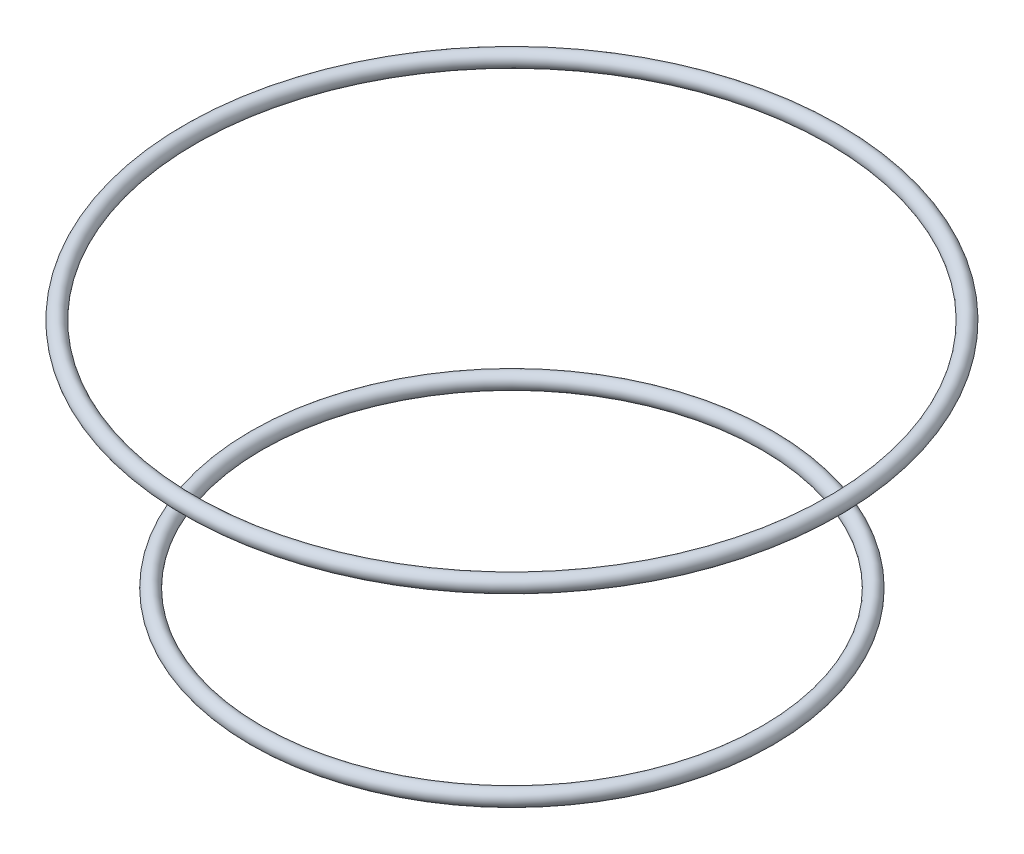
ISO-10303-21;
HEADER;
FILE_DESCRIPTION(('STEP AP214'),'2;1');
FILE_NAME('part.step','',(''),(''),'','','');
FILE_SCHEMA(('AUTOMOTIVE_DESIGN { 1 0 10303 214 1 1 1 1 }'));
ENDSEC;
DATA;
#1=APPLICATION_CONTEXT('core data for automotive mechanical design processes');
#2=APPLICATION_PROTOCOL_DEFINITION('international standard','automotive_design',2000,#1);
#3=PRODUCT_CONTEXT('',#1,'mechanical');
#4=PRODUCT('Part','Part','',(#3));
#5=PRODUCT_RELATED_PRODUCT_CATEGORY('part','',(#4));
#6=PRODUCT_DEFINITION_FORMATION('','',#4);
#7=PRODUCT_DEFINITION_CONTEXT('part definition',#1,'design');
#8=PRODUCT_DEFINITION('design','',#6,#7);
#9=PRODUCT_DEFINITION_SHAPE('','',#8);
#10=(LENGTH_UNIT() NAMED_UNIT(*) SI_UNIT(.MILLI.,.METRE.));
#11=(NAMED_UNIT(*) PLANE_ANGLE_UNIT() SI_UNIT($,.RADIAN.));
#12=(NAMED_UNIT(*) SI_UNIT($,.STERADIAN.) SOLID_ANGLE_UNIT());
#13=UNCERTAINTY_MEASURE_WITH_UNIT(LENGTH_MEASURE(1.E-05),#10,'distance_accuracy_value','');
#14=(GEOMETRIC_REPRESENTATION_CONTEXT(3) GLOBAL_UNCERTAINTY_ASSIGNED_CONTEXT((#13)) GLOBAL_UNIT_ASSIGNED_CONTEXT((#10,
#11,#12)) REPRESENTATION_CONTEXT('',''));
#15=CARTESIAN_POINT('',(0.,0.,0.));
#16=DIRECTION('',(0.,0.,1.));
#17=DIRECTION('',(1.,0.,0.));
#18=AXIS2_PLACEMENT_3D('',#15,#16,#17);
#19=CARTESIAN_POINT('',(0.,49.0000093273133,0.));
#20=DIRECTION('',(0.,-1.,0.));
#21=DIRECTION('',(0.,0.,-1.));
#22=AXIS2_PLACEMENT_3D('',#19,#20,#21);
#23=TOROIDAL_SURFACE('',#22,20.8090302154499,0.499999999999998);
#24=CARTESIAN_POINT('',(0.,49.0000093273133,-21.3090302154499));
#25=VERTEX_POINT('',#24);
#26=VERTEX_LOOP('',#25);
#27=FACE_BOUND('',#26,.T.);
#28=ADVANCED_FACE('P0_F13',(#27),#23,.T.);
#29=CLOSED_SHELL('',(#28));
#30=MANIFOLD_SOLID_BREP('P0_B1',#29);
#31=CARTESIAN_POINT('',(0.,34.0000093273133,0.));
#32=DIRECTION('',(0.,-1.,0.));
#33=DIRECTION('',(0.,0.,-1.));
#34=AXIS2_PLACEMENT_3D('',#31,#32,#33);
#35=TOROIDAL_SURFACE('',#34,16.5200378781698,0.5);
#36=CARTESIAN_POINT('',(0.,34.0000093273133,-17.0200378781698));
#37=VERTEX_POINT('',#36);
#38=VERTEX_LOOP('',#37);
#39=FACE_BOUND('',#38,.T.);
#40=ADVANCED_FACE('P1_F13',(#39),#35,.T.);
#41=CLOSED_SHELL('',(#40));
#42=MANIFOLD_SOLID_BREP('P1_B1',#41);
#43=ADVANCED_BREP_SHAPE_REPRESENTATION('',(#18,#30,#42),#14);
#44=SHAPE_DEFINITION_REPRESENTATION(#9,#43);
ENDSEC;
END-ISO-10303-21;
